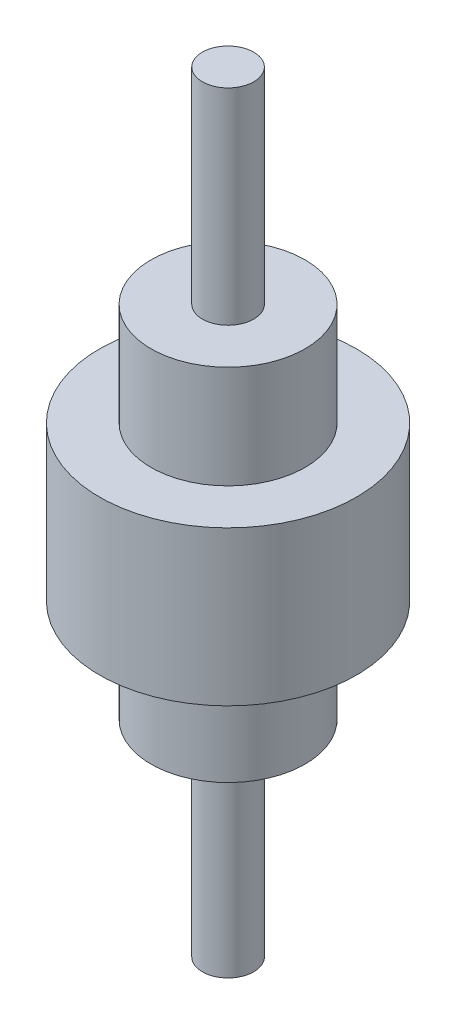
ISO-10303-21;
HEADER;
FILE_DESCRIPTION(('STEP AP214'),'2;1');
FILE_NAME('part.step','',(''),(''),'','','');
FILE_SCHEMA(('AUTOMOTIVE_DESIGN { 1 0 10303 214 1 1 1 1 }'));
ENDSEC;
DATA;
#1=APPLICATION_CONTEXT('core data for automotive mechanical design processes');
#2=APPLICATION_PROTOCOL_DEFINITION('international standard','automotive_design',2000,#1);
#3=PRODUCT_CONTEXT('',#1,'mechanical');
#4=PRODUCT('Part','Part','',(#3));
#5=PRODUCT_RELATED_PRODUCT_CATEGORY('part','',(#4));
#6=PRODUCT_DEFINITION_FORMATION('','',#4);
#7=PRODUCT_DEFINITION_CONTEXT('part definition',#1,'design');
#8=PRODUCT_DEFINITION('design','',#6,#7);
#9=PRODUCT_DEFINITION_SHAPE('','',#8);
#10=(LENGTH_UNIT() NAMED_UNIT(*) SI_UNIT(.MILLI.,.METRE.));
#11=(NAMED_UNIT(*) PLANE_ANGLE_UNIT() SI_UNIT($,.RADIAN.));
#12=(NAMED_UNIT(*) SI_UNIT($,.STERADIAN.) SOLID_ANGLE_UNIT());
#13=UNCERTAINTY_MEASURE_WITH_UNIT(LENGTH_MEASURE(1.E-05),#10,'distance_accuracy_value','');
#14=(GEOMETRIC_REPRESENTATION_CONTEXT(3) GLOBAL_UNCERTAINTY_ASSIGNED_CONTEXT((#13)) GLOBAL_UNIT_ASSIGNED_CONTEXT((#10,
#11,#12)) REPRESENTATION_CONTEXT('',''));
#15=CARTESIAN_POINT('',(0.,0.,0.));
#16=DIRECTION('',(0.,0.,1.));
#17=DIRECTION('',(1.,0.,0.));
#18=AXIS2_PLACEMENT_3D('',#15,#16,#17);
#19=CARTESIAN_POINT('',(0.,0.,0.));
#20=DIRECTION('',(0.,-1.,0.));
#21=DIRECTION('',(0.,0.,-1.));
#22=AXIS2_PLACEMENT_3D('',#19,#20,#21);
#23=PLANE('',#22);
#24=CARTESIAN_POINT('',(0.,0.,0.));
#25=DIRECTION('',(0.,-1.,0.));
#26=DIRECTION('',(0.,0.,-1.));
#27=AXIS2_PLACEMENT_3D('',#24,#25,#26);
#28=CIRCLE('',#27,100.);
#29=CARTESIAN_POINT('',(0.,0.,-100.));
#30=VERTEX_POINT('',#29);
#31=EDGE_CURVE('E10',#30,#30,#28,.T.);
#32=ORIENTED_EDGE('',*,*,#31,.T.);
#33=EDGE_LOOP('',(#32));
#34=FACE_BOUND('',#33,.T.);
#35=ADVANCED_FACE('F31',(#34),#23,.T.);
#36=CARTESIAN_POINT('',(0.,0.,0.));
#37=DIRECTION('',(0.,-1.,0.));
#38=DIRECTION('',(0.,0.,-1.));
#39=AXIS2_PLACEMENT_3D('',#36,#37,#38);
#40=CYLINDRICAL_SURFACE('',#39,100.);
#41=CARTESIAN_POINT('',(0.,800.,0.));
#42=DIRECTION('',(0.,-1.,0.));
#43=DIRECTION('',(0.,0.,-1.));
#44=AXIS2_PLACEMENT_3D('',#41,#42,#43);
#45=CIRCLE('',#44,100.);
#46=CARTESIAN_POINT('',(0.,800.,-100.));
#47=VERTEX_POINT('',#46);
#48=EDGE_CURVE('E37',#47,#47,#45,.T.);
#49=ORIENTED_EDGE('',*,*,#48,.T.);
#50=EDGE_LOOP('',(#49));
#51=FACE_BOUND('',#50,.T.);
#52=ORIENTED_EDGE('',*,*,#31,.F.);
#53=EDGE_LOOP('',(#52));
#54=FACE_BOUND('',#53,.T.);
#55=ADVANCED_FACE('F81',(#51,#54),#40,.T.);
#56=CARTESIAN_POINT('',(100.,800.,0.));
#57=DIRECTION('',(0.,-1.,0.));
#58=DIRECTION('',(0.,0.,-1.));
#59=AXIS2_PLACEMENT_3D('',#56,#57,#58);
#60=PLANE('',#59);
#61=CARTESIAN_POINT('',(0.,800.,0.));
#62=DIRECTION('',(0.,-1.,0.));
#63=DIRECTION('',(0.,0.,-1.));
#64=AXIS2_PLACEMENT_3D('',#61,#62,#63);
#65=CIRCLE('',#64,300.);
#66=CARTESIAN_POINT('',(0.,800.,-300.));
#67=VERTEX_POINT('',#66);
#68=EDGE_CURVE('E41',#67,#67,#65,.T.);
#69=ORIENTED_EDGE('',*,*,#68,.T.);
#70=EDGE_LOOP('',(#69));
#71=FACE_BOUND('',#70,.T.);
#72=ORIENTED_EDGE('',*,*,#48,.F.);
#73=EDGE_LOOP('',(#72));
#74=FACE_BOUND('',#73,.T.);
#75=ADVANCED_FACE('F85',(#71,#74),#60,.T.);
#76=CARTESIAN_POINT('',(0.,0.,0.));
#77=DIRECTION('',(0.,-1.,0.));
#78=DIRECTION('',(0.,0.,-1.));
#79=AXIS2_PLACEMENT_3D('',#76,#77,#78);
#80=CYLINDRICAL_SURFACE('',#79,300.);
#81=CARTESIAN_POINT('',(0.,1200.,0.));
#82=DIRECTION('',(0.,-1.,0.));
#83=DIRECTION('',(0.,0.,-1.));
#84=AXIS2_PLACEMENT_3D('',#81,#82,#83);
#85=CIRCLE('',#84,300.);
#86=CARTESIAN_POINT('',(0.,1200.,-300.));
#87=VERTEX_POINT('',#86);
#88=EDGE_CURVE('E45',#87,#87,#85,.T.);
#89=ORIENTED_EDGE('',*,*,#88,.T.);
#90=EDGE_LOOP('',(#89));
#91=FACE_BOUND('',#90,.T.);
#92=ORIENTED_EDGE('',*,*,#68,.F.);
#93=EDGE_LOOP('',(#92));
#94=FACE_BOUND('',#93,.T.);
#95=ADVANCED_FACE('F89',(#91,#94),#80,.T.);
#96=CARTESIAN_POINT('',(300.,1200.,0.));
#97=DIRECTION('',(0.,-1.,0.));
#98=DIRECTION('',(0.,0.,-1.));
#99=AXIS2_PLACEMENT_3D('',#96,#97,#98);
#100=PLANE('',#99);
#101=CARTESIAN_POINT('',(0.,1200.,0.));
#102=DIRECTION('',(0.,-1.,0.));
#103=DIRECTION('',(0.,0.,-1.));
#104=AXIS2_PLACEMENT_3D('',#101,#102,#103);
#105=CIRCLE('',#104,500.);
#106=CARTESIAN_POINT('',(0.,1200.,-500.));
#107=VERTEX_POINT('',#106);
#108=EDGE_CURVE('E50',#107,#107,#105,.T.);
#109=ORIENTED_EDGE('',*,*,#108,.T.);
#110=EDGE_LOOP('',(#109));
#111=FACE_BOUND('',#110,.T.);
#112=ORIENTED_EDGE('',*,*,#88,.F.);
#113=EDGE_LOOP('',(#112));
#114=FACE_BOUND('',#113,.T.);
#115=ADVANCED_FACE('F96',(#111,#114),#100,.T.);
#116=CARTESIAN_POINT('',(0.,0.,0.));
#117=DIRECTION('',(0.,-1.,0.));
#118=DIRECTION('',(0.,0.,-1.));
#119=AXIS2_PLACEMENT_3D('',#116,#117,#118);
#120=CYLINDRICAL_SURFACE('',#119,500.);
#121=CARTESIAN_POINT('',(0.,1800.,0.));
#122=DIRECTION('',(0.,-1.,0.));
#123=DIRECTION('',(0.,0.,-1.));
#124=AXIS2_PLACEMENT_3D('',#121,#122,#123);
#125=CIRCLE('',#124,500.);
#126=CARTESIAN_POINT('',(0.,1800.,-500.));
#127=VERTEX_POINT('',#126);
#128=EDGE_CURVE('E53',#127,#127,#125,.T.);
#129=ORIENTED_EDGE('',*,*,#128,.T.);
#130=EDGE_LOOP('',(#129));
#131=FACE_BOUND('',#130,.T.);
#132=ORIENTED_EDGE('',*,*,#108,.F.);
#133=EDGE_LOOP('',(#132));
#134=FACE_BOUND('',#133,.T.);
#135=ADVANCED_FACE('F100',(#131,#134),#120,.T.);
#136=CARTESIAN_POINT('',(500.,1800.,0.));
#137=DIRECTION('',(0.,1.,0.));
#138=DIRECTION('',(0.,0.,1.));
#139=AXIS2_PLACEMENT_3D('',#136,#137,#138);
#140=PLANE('',#139);
#141=CARTESIAN_POINT('',(0.,1800.,0.));
#142=DIRECTION('',(0.,-1.,0.));
#143=DIRECTION('',(0.,0.,-1.));
#144=AXIS2_PLACEMENT_3D('',#141,#142,#143);
#145=CIRCLE('',#144,300.);
#146=CARTESIAN_POINT('',(0.,1800.,-300.));
#147=VERTEX_POINT('',#146);
#148=EDGE_CURVE('E56',#147,#147,#145,.T.);
#149=ORIENTED_EDGE('',*,*,#148,.T.);
#150=EDGE_LOOP('',(#149));
#151=FACE_BOUND('',#150,.T.);
#152=ORIENTED_EDGE('',*,*,#128,.F.);
#153=EDGE_LOOP('',(#152));
#154=FACE_BOUND('',#153,.T.);
#155=ADVANCED_FACE('F104',(#151,#154),#140,.T.);
#156=CARTESIAN_POINT('',(0.,0.,0.));
#157=DIRECTION('',(0.,-1.,0.));
#158=DIRECTION('',(0.,0.,-1.));
#159=AXIS2_PLACEMENT_3D('',#156,#157,#158);
#160=CYLINDRICAL_SURFACE('',#159,300.);
#161=CARTESIAN_POINT('',(0.,2200.,0.));
#162=DIRECTION('',(0.,-1.,0.));
#163=DIRECTION('',(0.,0.,-1.));
#164=AXIS2_PLACEMENT_3D('',#161,#162,#163);
#165=CIRCLE('',#164,300.);
#166=CARTESIAN_POINT('',(0.,2200.,-300.));
#167=VERTEX_POINT('',#166);
#168=EDGE_CURVE('E59',#167,#167,#165,.T.);
#169=ORIENTED_EDGE('',*,*,#168,.T.);
#170=EDGE_LOOP('',(#169));
#171=FACE_BOUND('',#170,.T.);
#172=ORIENTED_EDGE('',*,*,#148,.F.);
#173=EDGE_LOOP('',(#172));
#174=FACE_BOUND('',#173,.T.);
#175=ADVANCED_FACE('F108',(#171,#174),#160,.T.);
#176=CARTESIAN_POINT('',(300.,2200.,0.));
#177=DIRECTION('',(0.,1.,0.));
#178=DIRECTION('',(0.,0.,1.));
#179=AXIS2_PLACEMENT_3D('',#176,#177,#178);
#180=PLANE('',#179);
#181=CARTESIAN_POINT('',(0.,2200.,0.));
#182=DIRECTION('',(0.,-1.,0.));
#183=DIRECTION('',(0.,0.,-1.));
#184=AXIS2_PLACEMENT_3D('',#181,#182,#183);
#185=CIRCLE('',#184,100.);
#186=CARTESIAN_POINT('',(0.,2200.,-100.));
#187=VERTEX_POINT('',#186);
#188=EDGE_CURVE('E62',#187,#187,#185,.T.);
#189=ORIENTED_EDGE('',*,*,#188,.T.);
#190=EDGE_LOOP('',(#189));
#191=FACE_BOUND('',#190,.T.);
#192=ORIENTED_EDGE('',*,*,#168,.F.);
#193=EDGE_LOOP('',(#192));
#194=FACE_BOUND('',#193,.T.);
#195=ADVANCED_FACE('F78',(#191,#194),#180,.T.);
#196=CARTESIAN_POINT('',(0.,0.,0.));
#197=DIRECTION('',(0.,-1.,0.));
#198=DIRECTION('',(0.,0.,-1.));
#199=AXIS2_PLACEMENT_3D('',#196,#197,#198);
#200=CYLINDRICAL_SURFACE('',#199,100.);
#201=CARTESIAN_POINT('',(0.,3000.,0.));
#202=DIRECTION('',(0.,-1.,0.));
#203=DIRECTION('',(0.,0.,-1.));
#204=AXIS2_PLACEMENT_3D('',#201,#202,#203);
#205=CIRCLE('',#204,100.);
#206=CARTESIAN_POINT('',(0.,3000.,-100.));
#207=VERTEX_POINT('',#206);
#208=EDGE_CURVE('E65',#207,#207,#205,.T.);
#209=ORIENTED_EDGE('',*,*,#208,.T.);
#210=EDGE_LOOP('',(#209));
#211=FACE_BOUND('',#210,.T.);
#212=ORIENTED_EDGE('',*,*,#188,.F.);
#213=EDGE_LOOP('',(#212));
#214=FACE_BOUND('',#213,.T.);
#215=ADVANCED_FACE('F69',(#211,#214),#200,.T.);
#216=CARTESIAN_POINT('',(100.,3000.,0.));
#217=DIRECTION('',(0.,1.,0.));
#218=DIRECTION('',(0.,0.,1.));
#219=AXIS2_PLACEMENT_3D('',#216,#217,#218);
#220=PLANE('',#219);
#221=ORIENTED_EDGE('',*,*,#208,.F.);
#222=EDGE_LOOP('',(#221));
#223=FACE_BOUND('',#222,.T.);
#224=ADVANCED_FACE('F72',(#223),#220,.T.);
#225=CLOSED_SHELL('',(#35,#55,#75,#95,#115,#135,#155,#175,#195,#215,#224));
#226=MANIFOLD_SOLID_BREP('B2',#225);
#227=ADVANCED_BREP_SHAPE_REPRESENTATION('',(#18,#226),#14);
#228=SHAPE_DEFINITION_REPRESENTATION(#9,#227);
ENDSEC;
END-ISO-10303-21;
